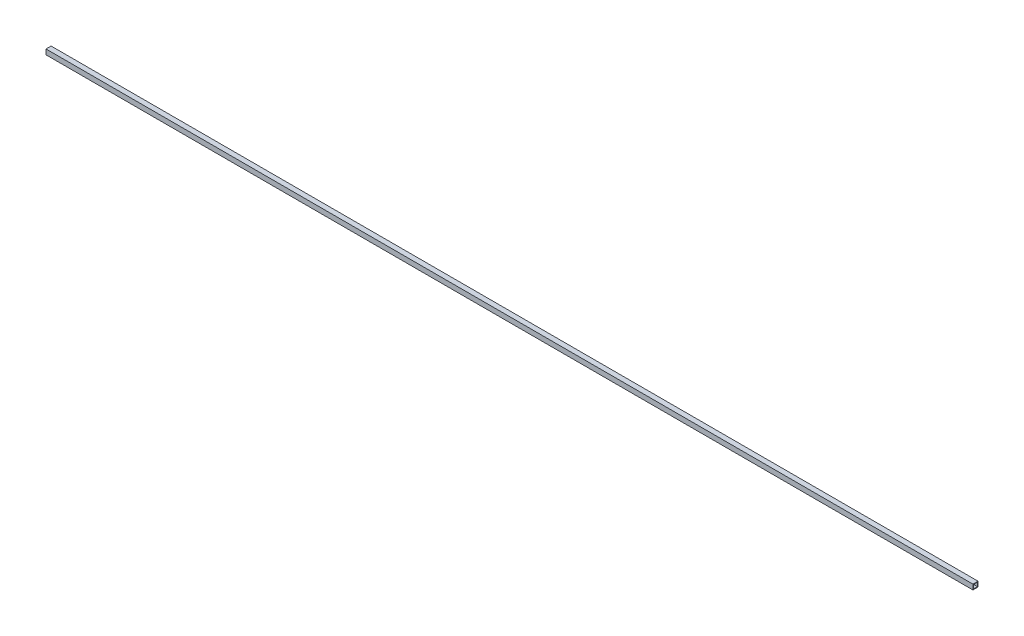
ISO-10303-21;
HEADER;
FILE_DESCRIPTION(('STEP AP214'),'2;1');
FILE_NAME('part.step','',(''),(''),'','','');
FILE_SCHEMA(('AUTOMOTIVE_DESIGN { 1 0 10303 214 1 1 1 1 }'));
ENDSEC;
DATA;
#1=APPLICATION_CONTEXT('core data for automotive mechanical design processes');
#2=APPLICATION_PROTOCOL_DEFINITION('international standard','automotive_design',2000,#1);
#3=PRODUCT_CONTEXT('',#1,'mechanical');
#4=PRODUCT('Part','Part','',(#3));
#5=PRODUCT_RELATED_PRODUCT_CATEGORY('part','',(#4));
#6=PRODUCT_DEFINITION_FORMATION('','',#4);
#7=PRODUCT_DEFINITION_CONTEXT('part definition',#1,'design');
#8=PRODUCT_DEFINITION('design','',#6,#7);
#9=PRODUCT_DEFINITION_SHAPE('','',#8);
#10=(LENGTH_UNIT() NAMED_UNIT(*) SI_UNIT(.MILLI.,.METRE.));
#11=(NAMED_UNIT(*) PLANE_ANGLE_UNIT() SI_UNIT($,.RADIAN.));
#12=(NAMED_UNIT(*) SI_UNIT($,.STERADIAN.) SOLID_ANGLE_UNIT());
#13=UNCERTAINTY_MEASURE_WITH_UNIT(LENGTH_MEASURE(1.E-05),#10,'distance_accuracy_value','');
#14=(GEOMETRIC_REPRESENTATION_CONTEXT(3) GLOBAL_UNCERTAINTY_ASSIGNED_CONTEXT((#13)) GLOBAL_UNIT_ASSIGNED_CONTEXT((#10,
#11,#12)) REPRESENTATION_CONTEXT('',''));
#15=CARTESIAN_POINT('',(0.,0.,0.));
#16=DIRECTION('',(0.,0.,1.));
#17=DIRECTION('',(1.,0.,0.));
#18=AXIS2_PLACEMENT_3D('',#15,#16,#17);
#19=CARTESIAN_POINT('',(9244.33,25.4,25.4));
#20=DIRECTION('',(0.,-1.,0.));
#21=DIRECTION('',(0.,0.,-1.));
#22=AXIS2_PLACEMENT_3D('',#19,#20,#21);
#23=PLANE('',#22);
#24=DIRECTION('',(0.,0.,1.));
#25=VECTOR('',#24,1.);
#26=CARTESIAN_POINT('',(0.,25.4,25.4));
#27=LINE('',#26,#25);
#28=CARTESIAN_POINT('',(0.,25.4,-25.4));
#29=VERTEX_POINT('',#28);
#30=CARTESIAN_POINT('',(0.,25.4,25.4));
#31=VERTEX_POINT('',#30);
#32=EDGE_CURVE('E171',#29,#31,#27,.T.);
#33=ORIENTED_EDGE('',*,*,#32,.T.);
#34=DIRECTION('',(-1.,0.,0.));
#35=VECTOR('',#34,1.);
#36=CARTESIAN_POINT('',(9244.33,25.4,25.4));
#37=LINE('',#36,#35);
#38=CARTESIAN_POINT('',(9244.33,25.4,25.4));
#39=VERTEX_POINT('',#38);
#40=EDGE_CURVE('E12',#39,#31,#37,.T.);
#41=ORIENTED_EDGE('',*,*,#40,.F.);
#42=DIRECTION('',(0.,0.,1.));
#43=VECTOR('',#42,1.);
#44=CARTESIAN_POINT('',(9244.33,25.4,25.4));
#45=LINE('',#44,#43);
#46=CARTESIAN_POINT('',(9244.33,25.4,-25.4));
#47=VERTEX_POINT('',#46);
#48=EDGE_CURVE('E137',#47,#39,#45,.T.);
#49=ORIENTED_EDGE('',*,*,#48,.F.);
#50=DIRECTION('',(-1.,0.,0.));
#51=VECTOR('',#50,1.);
#52=CARTESIAN_POINT('',(9244.33,25.4,-25.4));
#53=LINE('',#52,#51);
#54=EDGE_CURVE('E182',#47,#29,#53,.T.);
#55=ORIENTED_EDGE('',*,*,#54,.T.);
#56=EDGE_LOOP('',(#33,#41,#49,#55));
#57=FACE_BOUND('',#56,.T.);
#58=ADVANCED_FACE('F55',(#57),#23,.F.);
#59=CARTESIAN_POINT('',(9244.33,25.4,25.4));
#60=DIRECTION('',(0.,0.,-1.));
#61=DIRECTION('',(-1.,0.,0.));
#62=AXIS2_PLACEMENT_3D('',#59,#60,#61);
#63=PLANE('',#62);
#64=DIRECTION('',(0.,-1.,0.));
#65=VECTOR('',#64,1.);
#66=CARTESIAN_POINT('',(0.,25.4,25.4));
#67=LINE('',#66,#65);
#68=CARTESIAN_POINT('',(0.,-25.4,25.4));
#69=VERTEX_POINT('',#68);
#70=EDGE_CURVE('E143',#31,#69,#67,.T.);
#71=ORIENTED_EDGE('',*,*,#70,.T.);
#72=DIRECTION('',(-1.,0.,0.));
#73=VECTOR('',#72,1.);
#74=CARTESIAN_POINT('',(9244.33,-25.4,25.4));
#75=LINE('',#74,#73);
#76=CARTESIAN_POINT('',(9244.33,-25.4,25.4));
#77=VERTEX_POINT('',#76);
#78=EDGE_CURVE('E66',#77,#69,#75,.T.);
#79=ORIENTED_EDGE('',*,*,#78,.F.);
#80=DIRECTION('',(0.,-1.,0.));
#81=VECTOR('',#80,1.);
#82=CARTESIAN_POINT('',(9244.33,25.4,25.4));
#83=LINE('',#82,#81);
#84=EDGE_CURVE('E131',#39,#77,#83,.T.);
#85=ORIENTED_EDGE('',*,*,#84,.F.);
#86=ORIENTED_EDGE('',*,*,#40,.T.);
#87=EDGE_LOOP('',(#71,#79,#85,#86));
#88=FACE_BOUND('',#87,.T.);
#89=ADVANCED_FACE('F142',(#88),#63,.F.);
#90=CARTESIAN_POINT('',(9244.33,-25.4,-25.4));
#91=DIRECTION('',(0.,1.,0.));
#92=DIRECTION('',(0.,0.,1.));
#93=AXIS2_PLACEMENT_3D('',#90,#91,#92);
#94=PLANE('',#93);
#95=DIRECTION('',(0.,0.,-1.));
#96=VECTOR('',#95,1.);
#97=CARTESIAN_POINT('',(0.,-25.4,-25.4));
#98=LINE('',#97,#96);
#99=CARTESIAN_POINT('',(0.,-25.4,-25.4));
#100=VERTEX_POINT('',#99);
#101=EDGE_CURVE('E104',#69,#100,#98,.T.);
#102=ORIENTED_EDGE('',*,*,#101,.T.);
#103=DIRECTION('',(-1.,0.,0.));
#104=VECTOR('',#103,1.);
#105=CARTESIAN_POINT('',(9244.33,-25.4,-25.4));
#106=LINE('',#105,#104);
#107=CARTESIAN_POINT('',(9244.33,-25.4,-25.4));
#108=VERTEX_POINT('',#107);
#109=EDGE_CURVE('E145',#108,#100,#106,.T.);
#110=ORIENTED_EDGE('',*,*,#109,.F.);
#111=DIRECTION('',(0.,0.,-1.));
#112=VECTOR('',#111,1.);
#113=CARTESIAN_POINT('',(9244.33,-25.4,-25.4));
#114=LINE('',#113,#112);
#115=EDGE_CURVE('E135',#77,#108,#114,.T.);
#116=ORIENTED_EDGE('',*,*,#115,.F.);
#117=ORIENTED_EDGE('',*,*,#78,.T.);
#118=EDGE_LOOP('',(#102,#110,#116,#117));
#119=FACE_BOUND('',#118,.T.);
#120=ADVANCED_FACE('F147',(#119),#94,.F.);
#121=CARTESIAN_POINT('',(9244.33,19.05,19.05));
#122=DIRECTION('',(0.,0.,-1.));
#123=DIRECTION('',(-1.,0.,0.));
#124=AXIS2_PLACEMENT_3D('',#121,#122,#123);
#125=PLANE('',#124);
#126=DIRECTION('',(0.,-1.,0.));
#127=VECTOR('',#126,1.);
#128=CARTESIAN_POINT('',(0.,19.05,19.05));
#129=LINE('',#128,#127);
#130=CARTESIAN_POINT('',(0.,19.05,19.05));
#131=VERTEX_POINT('',#130);
#132=CARTESIAN_POINT('',(0.,-19.05,19.05));
#133=VERTEX_POINT('',#132);
#134=EDGE_CURVE('E155',#131,#133,#129,.T.);
#135=ORIENTED_EDGE('',*,*,#134,.F.);
#136=DIRECTION('',(-1.,0.,0.));
#137=VECTOR('',#136,1.);
#138=CARTESIAN_POINT('',(9244.33,19.05,19.05));
#139=LINE('',#138,#137);
#140=CARTESIAN_POINT('',(9244.33,19.05,19.05));
#141=VERTEX_POINT('',#140);
#142=EDGE_CURVE('E59',#141,#131,#139,.T.);
#143=ORIENTED_EDGE('',*,*,#142,.F.);
#144=DIRECTION('',(0.,-1.,0.));
#145=VECTOR('',#144,1.);
#146=CARTESIAN_POINT('',(9244.33,19.05,19.05));
#147=LINE('',#146,#145);
#148=CARTESIAN_POINT('',(9244.33,-19.05,19.05));
#149=VERTEX_POINT('',#148);
#150=EDGE_CURVE('E181',#141,#149,#147,.T.);
#151=ORIENTED_EDGE('',*,*,#150,.T.);
#152=DIRECTION('',(-1.,0.,0.));
#153=VECTOR('',#152,1.);
#154=CARTESIAN_POINT('',(9244.33,-19.05,19.05));
#155=LINE('',#154,#153);
#156=EDGE_CURVE('E151',#149,#133,#155,.T.);
#157=ORIENTED_EDGE('',*,*,#156,.T.);
#158=EDGE_LOOP('',(#135,#143,#151,#157));
#159=FACE_BOUND('',#158,.T.);
#160=ADVANCED_FACE('F57',(#159),#125,.T.);
#161=CARTESIAN_POINT('',(9244.33,19.05,19.05));
#162=DIRECTION('',(0.,-1.,0.));
#163=DIRECTION('',(0.,0.,-1.));
#164=AXIS2_PLACEMENT_3D('',#161,#162,#163);
#165=PLANE('',#164);
#166=DIRECTION('',(0.,0.,1.));
#167=VECTOR('',#166,1.);
#168=CARTESIAN_POINT('',(0.,19.05,19.05));
#169=LINE('',#168,#167);
#170=CARTESIAN_POINT('',(0.,19.05,-19.05));
#171=VERTEX_POINT('',#170);
#172=EDGE_CURVE('E159',#171,#131,#169,.T.);
#173=ORIENTED_EDGE('',*,*,#172,.F.);
#174=DIRECTION('',(-1.,0.,0.));
#175=VECTOR('',#174,1.);
#176=CARTESIAN_POINT('',(9244.33,19.05,-19.05));
#177=LINE('',#176,#175);
#178=CARTESIAN_POINT('',(9244.33,19.05,-19.05));
#179=VERTEX_POINT('',#178);
#180=EDGE_CURVE('E191',#179,#171,#177,.T.);
#181=ORIENTED_EDGE('',*,*,#180,.F.);
#182=DIRECTION('',(0.,0.,1.));
#183=VECTOR('',#182,1.);
#184=CARTESIAN_POINT('',(9244.33,19.05,19.05));
#185=LINE('',#184,#183);
#186=EDGE_CURVE('E202',#179,#141,#185,.T.);
#187=ORIENTED_EDGE('',*,*,#186,.T.);
#188=ORIENTED_EDGE('',*,*,#142,.T.);
#189=EDGE_LOOP('',(#173,#181,#187,#188));
#190=FACE_BOUND('',#189,.T.);
#191=ADVANCED_FACE('F200',(#190),#165,.T.);
#192=CARTESIAN_POINT('',(9244.33,-19.05,-19.05));
#193=DIRECTION('',(0.,0.,1.));
#194=DIRECTION('',(1.,0.,0.));
#195=AXIS2_PLACEMENT_3D('',#192,#193,#194);
#196=PLANE('',#195);
#197=DIRECTION('',(0.,1.,0.));
#198=VECTOR('',#197,1.);
#199=CARTESIAN_POINT('',(0.,-19.05,-19.05));
#200=LINE('',#199,#198);
#201=CARTESIAN_POINT('',(0.,-19.05,-19.05));
#202=VERTEX_POINT('',#201);
#203=EDGE_CURVE('E163',#202,#171,#200,.T.);
#204=ORIENTED_EDGE('',*,*,#203,.F.);
#205=DIRECTION('',(-1.,0.,0.));
#206=VECTOR('',#205,1.);
#207=CARTESIAN_POINT('',(9244.33,-19.05,-19.05));
#208=LINE('',#207,#206);
#209=CARTESIAN_POINT('',(9244.33,-19.05,-19.05));
#210=VERTEX_POINT('',#209);
#211=EDGE_CURVE('E189',#210,#202,#208,.T.);
#212=ORIENTED_EDGE('',*,*,#211,.F.);
#213=DIRECTION('',(0.,1.,0.));
#214=VECTOR('',#213,1.);
#215=CARTESIAN_POINT('',(9244.33,-19.05,-19.05));
#216=LINE('',#215,#214);
#217=EDGE_CURVE('E209',#210,#179,#216,.T.);
#218=ORIENTED_EDGE('',*,*,#217,.T.);
#219=ORIENTED_EDGE('',*,*,#180,.T.);
#220=EDGE_LOOP('',(#204,#212,#218,#219));
#221=FACE_BOUND('',#220,.T.);
#222=ADVANCED_FACE('F207',(#221),#196,.T.);
#223=CARTESIAN_POINT('',(9244.33,-19.05,-19.05));
#224=DIRECTION('',(0.,1.,0.));
#225=DIRECTION('',(0.,0.,1.));
#226=AXIS2_PLACEMENT_3D('',#223,#224,#225);
#227=PLANE('',#226);
#228=DIRECTION('',(0.,0.,-1.));
#229=VECTOR('',#228,1.);
#230=CARTESIAN_POINT('',(0.,-19.05,-19.05));
#231=LINE('',#230,#229);
#232=EDGE_CURVE('E167',#133,#202,#231,.T.);
#233=ORIENTED_EDGE('',*,*,#232,.F.);
#234=ORIENTED_EDGE('',*,*,#156,.F.);
#235=DIRECTION('',(0.,0.,-1.));
#236=VECTOR('',#235,1.);
#237=CARTESIAN_POINT('',(9244.33,-19.05,-19.05));
#238=LINE('',#237,#236);
#239=EDGE_CURVE('E214',#149,#210,#238,.T.);
#240=ORIENTED_EDGE('',*,*,#239,.T.);
#241=ORIENTED_EDGE('',*,*,#211,.T.);
#242=EDGE_LOOP('',(#233,#234,#240,#241));
#243=FACE_BOUND('',#242,.T.);
#244=ADVANCED_FACE('F217',(#243),#227,.T.);
#245=CARTESIAN_POINT('',(9244.33,-25.4,-25.4));
#246=DIRECTION('',(0.,0.,1.));
#247=DIRECTION('',(0.,-1.,0.));
#248=AXIS2_PLACEMENT_3D('',#245,#246,#247);
#249=PLANE('',#248);
#250=DIRECTION('',(0.,1.,0.));
#251=VECTOR('',#250,1.);
#252=CARTESIAN_POINT('',(0.,-25.4,-25.4));
#253=LINE('',#252,#251);
#254=EDGE_CURVE('E110',#100,#29,#253,.T.);
#255=ORIENTED_EDGE('',*,*,#254,.T.);
#256=ORIENTED_EDGE('',*,*,#54,.F.);
#257=DIRECTION('',(0.,1.,0.));
#258=VECTOR('',#257,1.);
#259=CARTESIAN_POINT('',(9244.33,-25.4,-25.4));
#260=LINE('',#259,#258);
#261=EDGE_CURVE('E75',#108,#47,#260,.T.);
#262=ORIENTED_EDGE('',*,*,#261,.F.);
#263=ORIENTED_EDGE('',*,*,#109,.T.);
#264=EDGE_LOOP('',(#255,#256,#262,#263));
#265=FACE_BOUND('',#264,.T.);
#266=ADVANCED_FACE('F226',(#265),#249,.F.);
#267=CARTESIAN_POINT('',(9244.33,0.,0.));
#268=DIRECTION('',(1.,0.,0.));
#269=DIRECTION('',(0.,0.,-1.));
#270=AXIS2_PLACEMENT_3D('',#267,#268,#269);
#271=PLANE('',#270);
#272=ORIENTED_EDGE('',*,*,#150,.F.);
#273=ORIENTED_EDGE('',*,*,#186,.F.);
#274=ORIENTED_EDGE('',*,*,#217,.F.);
#275=ORIENTED_EDGE('',*,*,#239,.F.);
#276=EDGE_LOOP('',(#272,#273,#274,#275));
#277=FACE_BOUND('',#276,.T.);
#278=ORIENTED_EDGE('',*,*,#48,.T.);
#279=ORIENTED_EDGE('',*,*,#84,.T.);
#280=ORIENTED_EDGE('',*,*,#115,.T.);
#281=ORIENTED_EDGE('',*,*,#261,.T.);
#282=EDGE_LOOP('',(#278,#279,#280,#281));
#283=FACE_BOUND('',#282,.T.);
#284=ADVANCED_FACE('F133',(#277,#283),#271,.T.);
#285=CARTESIAN_POINT('',(0.,0.,0.));
#286=DIRECTION('',(1.,0.,0.));
#287=DIRECTION('',(0.,0.,-1.));
#288=AXIS2_PLACEMENT_3D('',#285,#286,#287);
#289=PLANE('',#288);
#290=ORIENTED_EDGE('',*,*,#134,.T.);
#291=ORIENTED_EDGE('',*,*,#232,.T.);
#292=ORIENTED_EDGE('',*,*,#203,.T.);
#293=ORIENTED_EDGE('',*,*,#172,.T.);
#294=EDGE_LOOP('',(#290,#291,#292,#293));
#295=FACE_BOUND('',#294,.T.);
#296=ORIENTED_EDGE('',*,*,#32,.F.);
#297=ORIENTED_EDGE('',*,*,#254,.F.);
#298=ORIENTED_EDGE('',*,*,#101,.F.);
#299=ORIENTED_EDGE('',*,*,#70,.F.);
#300=EDGE_LOOP('',(#296,#297,#298,#299));
#301=FACE_BOUND('',#300,.T.);
#302=ADVANCED_FACE('F205',(#295,#301),#289,.F.);
#303=CLOSED_SHELL('',(#58,#89,#120,#160,#191,#222,#244,#266,#284,#302));
#304=MANIFOLD_SOLID_BREP('B2',#303);
#305=ADVANCED_BREP_SHAPE_REPRESENTATION('',(#18,#304),#14);
#306=SHAPE_DEFINITION_REPRESENTATION(#9,#305);
ENDSEC;
END-ISO-10303-21;
